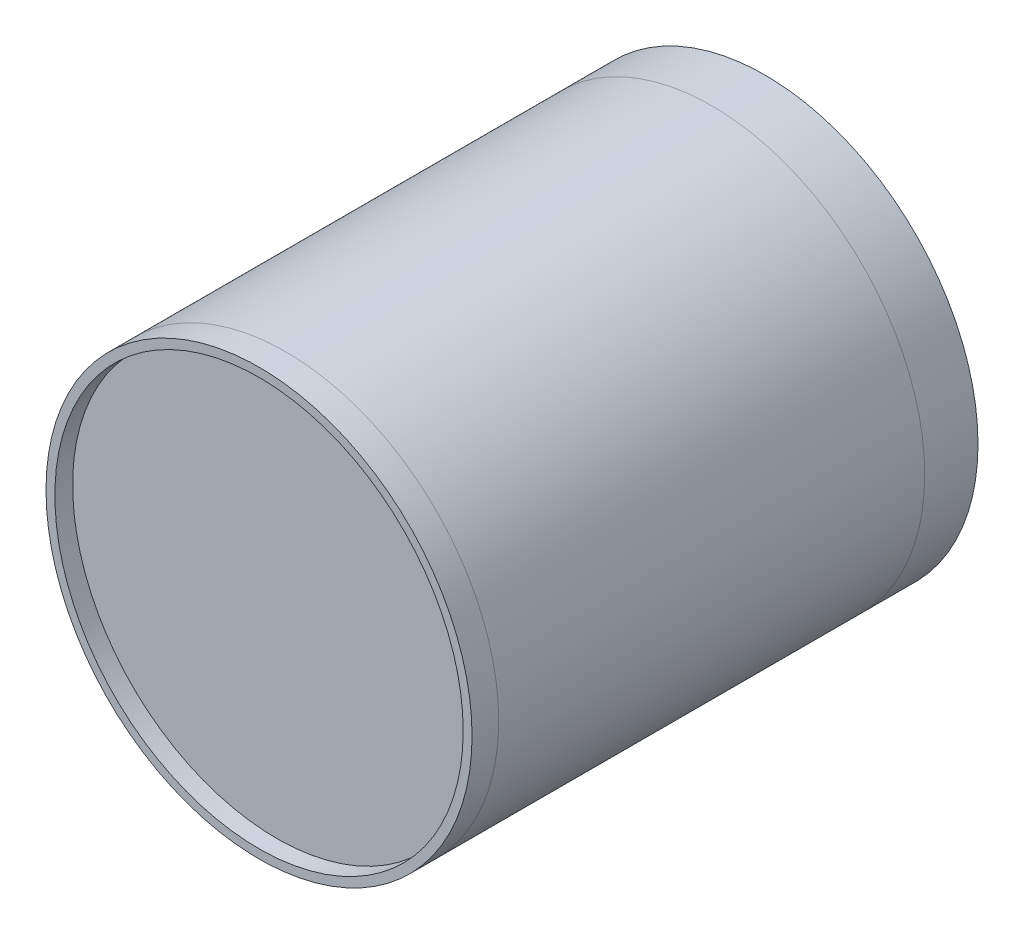
ISO-10303-21;
HEADER;
FILE_DESCRIPTION(('STEP AP214'),'2;1');
FILE_NAME('part.step','',(''),(''),'','','');
FILE_SCHEMA(('AUTOMOTIVE_DESIGN { 1 0 10303 214 1 1 1 1 }'));
ENDSEC;
DATA;
#1=APPLICATION_CONTEXT('core data for automotive mechanical design processes');
#2=APPLICATION_PROTOCOL_DEFINITION('international standard','automotive_design',2000,#1);
#3=PRODUCT_CONTEXT('',#1,'mechanical');
#4=PRODUCT('Part','Part','',(#3));
#5=PRODUCT_RELATED_PRODUCT_CATEGORY('part','',(#4));
#6=PRODUCT_DEFINITION_FORMATION('','',#4);
#7=PRODUCT_DEFINITION_CONTEXT('part definition',#1,'design');
#8=PRODUCT_DEFINITION('design','',#6,#7);
#9=PRODUCT_DEFINITION_SHAPE('','',#8);
#10=(LENGTH_UNIT() NAMED_UNIT(*) SI_UNIT(.MILLI.,.METRE.));
#11=(NAMED_UNIT(*) PLANE_ANGLE_UNIT() SI_UNIT($,.RADIAN.));
#12=(NAMED_UNIT(*) SI_UNIT($,.STERADIAN.) SOLID_ANGLE_UNIT());
#13=UNCERTAINTY_MEASURE_WITH_UNIT(LENGTH_MEASURE(1.E-05),#10,'distance_accuracy_value','');
#14=(GEOMETRIC_REPRESENTATION_CONTEXT(3) GLOBAL_UNCERTAINTY_ASSIGNED_CONTEXT((#13)) GLOBAL_UNIT_ASSIGNED_CONTEXT((#10,
#11,#12)) REPRESENTATION_CONTEXT('',''));
#15=CARTESIAN_POINT('',(0.,0.,0.));
#16=DIRECTION('',(0.,0.,1.));
#17=DIRECTION('',(1.,0.,0.));
#18=AXIS2_PLACEMENT_3D('',#15,#16,#17);
#19=CARTESIAN_POINT('',(0.,0.,1295.4));
#20=DIRECTION('',(0.,0.,-1.));
#21=DIRECTION('',(-1.,0.,0.));
#22=AXIS2_PLACEMENT_3D('',#19,#20,#21);
#23=CYLINDRICAL_SURFACE('',#22,609.6);
#24=CARTESIAN_POINT('',(0.,0.,1295.4));
#25=DIRECTION('',(0.,0.,1.));
#26=DIRECTION('',(1.,0.,0.));
#27=AXIS2_PLACEMENT_3D('',#24,#25,#26);
#28=CIRCLE('',#27,609.6);
#29=CARTESIAN_POINT('',(609.6,0.,1295.4));
#30=VERTEX_POINT('',#29);
#31=EDGE_CURVE('E12',#30,#30,#28,.T.);
#32=ORIENTED_EDGE('',*,*,#31,.F.);
#33=EDGE_LOOP('',(#32));
#34=FACE_BOUND('',#33,.T.);
#35=CARTESIAN_POINT('',(0.,0.,1219.2));
#36=DIRECTION('',(0.,0.,1.));
#37=DIRECTION('',(1.,0.,0.));
#38=AXIS2_PLACEMENT_3D('',#35,#36,#37);
#39=CIRCLE('',#38,609.6);
#40=CARTESIAN_POINT('',(609.6,0.,1219.2));
#41=VERTEX_POINT('',#40);
#42=EDGE_CURVE('E50',#41,#41,#39,.T.);
#43=ORIENTED_EDGE('',*,*,#42,.T.);
#44=EDGE_LOOP('',(#43));
#45=FACE_BOUND('',#44,.T.);
#46=ADVANCED_FACE('F47',(#34,#45),#23,.T.);
#47=CARTESIAN_POINT('',(0.,0.,1295.4));
#48=DIRECTION('',(0.,0.,1.));
#49=DIRECTION('',(1.,0.,0.));
#50=AXIS2_PLACEMENT_3D('',#47,#48,#49);
#51=PLANE('',#50);
#52=CARTESIAN_POINT('',(0.,0.,1295.4));
#53=DIRECTION('',(0.,0.,1.));
#54=DIRECTION('',(1.,0.,0.));
#55=AXIS2_PLACEMENT_3D('',#52,#53,#54);
#56=CIRCLE('',#55,584.2);
#57=CARTESIAN_POINT('',(584.2,0.,1295.4));
#58=VERTEX_POINT('',#57);
#59=EDGE_CURVE('E61',#58,#58,#56,.T.);
#60=ORIENTED_EDGE('',*,*,#59,.F.);
#61=EDGE_LOOP('',(#60));
#62=FACE_BOUND('',#61,.T.);
#63=ORIENTED_EDGE('',*,*,#31,.T.);
#64=EDGE_LOOP('',(#63));
#65=FACE_BOUND('',#64,.T.);
#66=ADVANCED_FACE('F67',(#62,#65),#51,.T.);
#67=CARTESIAN_POINT('',(0.,0.,1219.2));
#68=DIRECTION('',(0.,0.,1.));
#69=DIRECTION('',(1.,0.,0.));
#70=AXIS2_PLACEMENT_3D('',#67,#68,#69);
#71=PLANE('',#70);
#72=ORIENTED_EDGE('',*,*,#42,.F.);
#73=EDGE_LOOP('',(#72));
#74=FACE_BOUND('',#73,.T.);
#75=ADVANCED_FACE('F69',(#74),#71,.F.);
#76=CARTESIAN_POINT('',(0.,0.,-433.167126276724));
#77=DIRECTION('',(0.,0.,1.));
#78=DIRECTION('',(1.,0.,0.));
#79=AXIS2_PLACEMENT_3D('',#76,#77,#78);
#80=CYLINDRICAL_SURFACE('',#79,584.2);
#81=CARTESIAN_POINT('',(0.,0.,1244.6));
#82=DIRECTION('',(0.,0.,1.));
#83=DIRECTION('',(1.,0.,0.));
#84=AXIS2_PLACEMENT_3D('',#81,#82,#83);
#85=CIRCLE('',#84,584.2);
#86=CARTESIAN_POINT('',(584.2,0.,1244.6));
#87=VERTEX_POINT('',#86);
#88=EDGE_CURVE('E57',#87,#87,#85,.F.);
#89=ORIENTED_EDGE('',*,*,#88,.T.);
#90=EDGE_LOOP('',(#89));
#91=FACE_BOUND('',#90,.T.);
#92=ORIENTED_EDGE('',*,*,#59,.T.);
#93=EDGE_LOOP('',(#92));
#94=FACE_BOUND('',#93,.T.);
#95=ADVANCED_FACE('F65',(#91,#94),#80,.F.);
#96=CARTESIAN_POINT('',(0.,0.,1244.6));
#97=DIRECTION('',(0.,0.,1.));
#98=DIRECTION('',(1.,0.,0.));
#99=AXIS2_PLACEMENT_3D('',#96,#97,#98);
#100=PLANE('',#99);
#101=ORIENTED_EDGE('',*,*,#88,.F.);
#102=EDGE_LOOP('',(#101));
#103=FACE_BOUND('',#102,.T.);
#104=ADVANCED_FACE('F80',(#103),#100,.T.);
#105=CLOSED_SHELL('',(#46,#66,#75,#95,#104));
#106=MANIFOLD_SOLID_BREP('B2',#105);
#107=CARTESIAN_POINT('',(0.,0.,1219.2));
#108=DIRECTION('',(0.,0.,-1.));
#109=DIRECTION('',(-1.,0.,0.));
#110=AXIS2_PLACEMENT_3D('',#107,#108,#109);
#111=CYLINDRICAL_SURFACE('',#110,603.25);
#112=CARTESIAN_POINT('',(0.,0.,1219.2));
#113=DIRECTION('',(0.,0.,1.));
#114=DIRECTION('',(1.,0.,0.));
#115=AXIS2_PLACEMENT_3D('',#112,#113,#114);
#116=CIRCLE('',#115,603.25);
#117=CARTESIAN_POINT('',(603.25,0.,1219.2));
#118=VERTEX_POINT('',#117);
#119=EDGE_CURVE('E145',#118,#118,#116,.T.);
#120=ORIENTED_EDGE('',*,*,#119,.T.);
#121=EDGE_LOOP('',(#120));
#122=FACE_BOUND('',#121,.T.);
#123=CARTESIAN_POINT('',(0.,0.,0.));
#124=DIRECTION('',(0.,0.,1.));
#125=DIRECTION('',(1.,0.,0.));
#126=AXIS2_PLACEMENT_3D('',#123,#124,#125);
#127=CIRCLE('',#126,603.25);
#128=CARTESIAN_POINT('',(603.25,0.,0.));
#129=VERTEX_POINT('',#128);
#130=EDGE_CURVE('E151',#129,#129,#127,.T.);
#131=ORIENTED_EDGE('',*,*,#130,.F.);
#132=EDGE_LOOP('',(#131));
#133=FACE_BOUND('',#132,.T.);
#134=ADVANCED_FACE('F138',(#122,#133),#111,.F.);
#135=CARTESIAN_POINT('',(0.,0.,1219.2));
#136=DIRECTION('',(0.,0.,-1.));
#137=DIRECTION('',(-1.,0.,0.));
#138=AXIS2_PLACEMENT_3D('',#135,#136,#137);
#139=CYLINDRICAL_SURFACE('',#138,609.6);
#140=CARTESIAN_POINT('',(0.,0.,1219.2));
#141=DIRECTION('',(0.,0.,1.));
#142=DIRECTION('',(1.,0.,0.));
#143=AXIS2_PLACEMENT_3D('',#140,#141,#142);
#144=CIRCLE('',#143,609.6);
#145=CARTESIAN_POINT('',(609.6,0.,1219.2));
#146=VERTEX_POINT('',#145);
#147=EDGE_CURVE('E46',#146,#146,#144,.T.);
#148=ORIENTED_EDGE('',*,*,#147,.F.);
#149=EDGE_LOOP('',(#148));
#150=FACE_BOUND('',#149,.T.);
#151=CARTESIAN_POINT('',(0.,0.,0.));
#152=DIRECTION('',(0.,0.,1.));
#153=DIRECTION('',(1.,0.,0.));
#154=AXIS2_PLACEMENT_3D('',#151,#152,#153);
#155=CIRCLE('',#154,609.6);
#156=CARTESIAN_POINT('',(609.6,0.,0.));
#157=VERTEX_POINT('',#156);
#158=EDGE_CURVE('E141',#157,#157,#155,.T.);
#159=ORIENTED_EDGE('',*,*,#158,.T.);
#160=EDGE_LOOP('',(#159));
#161=FACE_BOUND('',#160,.T.);
#162=ADVANCED_FACE('F158',(#150,#161),#139,.T.);
#163=CARTESIAN_POINT('',(0.,0.,1219.2));
#164=DIRECTION('',(0.,0.,1.));
#165=DIRECTION('',(1.,0.,0.));
#166=AXIS2_PLACEMENT_3D('',#163,#164,#165);
#167=PLANE('',#166);
#168=ORIENTED_EDGE('',*,*,#119,.F.);
#169=EDGE_LOOP('',(#168));
#170=FACE_BOUND('',#169,.T.);
#171=ORIENTED_EDGE('',*,*,#147,.T.);
#172=EDGE_LOOP('',(#171));
#173=FACE_BOUND('',#172,.T.);
#174=ADVANCED_FACE('F162',(#170,#173),#167,.T.);
#175=CARTESIAN_POINT('',(0.,0.,0.));
#176=DIRECTION('',(0.,0.,1.));
#177=DIRECTION('',(1.,0.,0.));
#178=AXIS2_PLACEMENT_3D('',#175,#176,#177);
#179=PLANE('',#178);
#180=ORIENTED_EDGE('',*,*,#130,.T.);
#181=EDGE_LOOP('',(#180));
#182=FACE_BOUND('',#181,.T.);
#183=ORIENTED_EDGE('',*,*,#158,.F.);
#184=EDGE_LOOP('',(#183));
#185=FACE_BOUND('',#184,.T.);
#186=ADVANCED_FACE('F160',(#182,#185),#179,.F.);
#187=CLOSED_SHELL('',(#134,#162,#174,#186));
#188=MANIFOLD_SOLID_BREP('B7_NOT_SHOWN',#187);
#189=CARTESIAN_POINT('',(0.,0.,-152.4));
#190=DIRECTION('',(0.,0.,1.));
#191=DIRECTION('',(1.,0.,0.));
#192=AXIS2_PLACEMENT_3D('',#189,#190,#191);
#193=CYLINDRICAL_SURFACE('',#192,609.6);
#194=CARTESIAN_POINT('',(0.,0.,-152.4));
#195=DIRECTION('',(0.,0.,1.));
#196=DIRECTION('',(1.,0.,0.));
#197=AXIS2_PLACEMENT_3D('',#194,#195,#196);
#198=CIRCLE('',#197,609.6);
#199=CARTESIAN_POINT('',(609.6,0.,-152.4));
#200=VERTEX_POINT('',#199);
#201=EDGE_CURVE('E137',#200,#200,#198,.T.);
#202=ORIENTED_EDGE('',*,*,#201,.T.);
#203=EDGE_LOOP('',(#202));
#204=FACE_BOUND('',#203,.T.);
#205=CARTESIAN_POINT('',(0.,0.,0.));
#206=DIRECTION('',(0.,0.,1.));
#207=DIRECTION('',(1.,0.,0.));
#208=AXIS2_PLACEMENT_3D('',#205,#206,#207);
#209=CIRCLE('',#208,609.6);
#210=CARTESIAN_POINT('',(609.6,0.,0.));
#211=VERTEX_POINT('',#210);
#212=EDGE_CURVE('E209',#211,#211,#209,.T.);
#213=ORIENTED_EDGE('',*,*,#212,.F.);
#214=EDGE_LOOP('',(#213));
#215=FACE_BOUND('',#214,.T.);
#216=ADVANCED_FACE('F202',(#204,#215),#193,.T.);
#217=CARTESIAN_POINT('',(0.,0.,-152.4));
#218=DIRECTION('',(0.,0.,1.));
#219=DIRECTION('',(1.,0.,0.));
#220=AXIS2_PLACEMENT_3D('',#217,#218,#219);
#221=PLANE('',#220);
#222=ORIENTED_EDGE('',*,*,#201,.F.);
#223=EDGE_LOOP('',(#222));
#224=FACE_BOUND('',#223,.T.);
#225=ADVANCED_FACE('F244',(#224),#221,.F.);
#226=CARTESIAN_POINT('',(0.,0.,0.));
#227=DIRECTION('',(0.,0.,1.));
#228=DIRECTION('',(1.,0.,0.));
#229=AXIS2_PLACEMENT_3D('',#226,#227,#228);
#230=PLANE('',#229);
#231=CARTESIAN_POINT('',(0.,0.,0.));
#232=DIRECTION('',(0.,0.,1.));
#233=DIRECTION('',(1.,0.,0.));
#234=AXIS2_PLACEMENT_3D('',#231,#232,#233);
#235=CIRCLE('',#234,76.2);
#236=CARTESIAN_POINT('',(76.2,0.,0.));
#237=VERTEX_POINT('',#236);
#238=EDGE_CURVE('E216',#237,#237,#235,.T.);
#239=ORIENTED_EDGE('',*,*,#238,.F.);
#240=EDGE_LOOP('',(#239));
#241=FACE_BOUND('',#240,.T.);
#242=ORIENTED_EDGE('',*,*,#212,.T.);
#243=EDGE_LOOP('',(#242));
#244=FACE_BOUND('',#243,.T.);
#245=ADVANCED_FACE('F248',(#241,#244),#230,.T.);
#246=CARTESIAN_POINT('',(0.,0.,25.4));
#247=DIRECTION('',(0.,0.,-1.));
#248=DIRECTION('',(-1.,0.,0.));
#249=AXIS2_PLACEMENT_3D('',#246,#247,#248);
#250=CYLINDRICAL_SURFACE('',#249,76.2);
#251=CARTESIAN_POINT('',(0.,0.,25.4));
#252=DIRECTION('',(0.,0.,1.));
#253=DIRECTION('',(1.,0.,0.));
#254=AXIS2_PLACEMENT_3D('',#251,#252,#253);
#255=CIRCLE('',#254,76.2);
#256=CARTESIAN_POINT('',(76.2,0.,25.4));
#257=VERTEX_POINT('',#256);
#258=EDGE_CURVE('E214',#257,#257,#255,.T.);
#259=ORIENTED_EDGE('',*,*,#258,.F.);
#260=EDGE_LOOP('',(#259));
#261=FACE_BOUND('',#260,.T.);
#262=ORIENTED_EDGE('',*,*,#238,.T.);
#263=EDGE_LOOP('',(#262));
#264=FACE_BOUND('',#263,.T.);
#265=ADVANCED_FACE('F241',(#261,#264),#250,.T.);
#266=CARTESIAN_POINT('',(0.,0.,25.4));
#267=DIRECTION('',(0.,0.,1.));
#268=DIRECTION('',(1.,0.,0.));
#269=AXIS2_PLACEMENT_3D('',#266,#267,#268);
#270=PLANE('',#269);
#271=CARTESIAN_POINT('',(0.,0.,25.4));
#272=DIRECTION('',(0.,0.,1.));
#273=DIRECTION('',(1.,0.,0.));
#274=AXIS2_PLACEMENT_3D('',#271,#272,#273);
#275=CIRCLE('',#274,25.4);
#276=CARTESIAN_POINT('',(25.4,0.,25.4));
#277=VERTEX_POINT('',#276);
#278=EDGE_CURVE('E205',#277,#277,#275,.F.);
#279=ORIENTED_EDGE('',*,*,#278,.T.);
#280=EDGE_LOOP('',(#279));
#281=FACE_BOUND('',#280,.T.);
#282=ORIENTED_EDGE('',*,*,#258,.T.);
#283=EDGE_LOOP('',(#282));
#284=FACE_BOUND('',#283,.T.);
#285=ADVANCED_FACE('F228',(#281,#284),#270,.T.);
#286=CARTESIAN_POINT('',(0.,0.,50.8));
#287=DIRECTION('',(0.,0.,-1.));
#288=DIRECTION('',(-1.,0.,0.));
#289=AXIS2_PLACEMENT_3D('',#286,#287,#288);
#290=CYLINDRICAL_SURFACE('',#289,25.4);
#291=ORIENTED_EDGE('',*,*,#278,.F.);
#292=EDGE_LOOP('',(#291));
#293=FACE_BOUND('',#292,.T.);
#294=CARTESIAN_POINT('',(0.,0.,50.8));
#295=DIRECTION('',(0.,0.,1.));
#296=DIRECTION('',(1.,0.,0.));
#297=AXIS2_PLACEMENT_3D('',#294,#295,#296);
#298=CIRCLE('',#297,25.4);
#299=CARTESIAN_POINT('',(25.4,0.,50.8));
#300=VERTEX_POINT('',#299);
#301=EDGE_CURVE('E221',#300,#300,#298,.T.);
#302=ORIENTED_EDGE('',*,*,#301,.F.);
#303=EDGE_LOOP('',(#302));
#304=FACE_BOUND('',#303,.T.);
#305=ADVANCED_FACE('F231',(#293,#304),#290,.T.);
#306=CARTESIAN_POINT('',(0.,0.,50.8));
#307=DIRECTION('',(0.,0.,1.));
#308=DIRECTION('',(1.,0.,0.));
#309=AXIS2_PLACEMENT_3D('',#306,#307,#308);
#310=PLANE('',#309);
#311=ORIENTED_EDGE('',*,*,#301,.T.);
#312=EDGE_LOOP('',(#311));
#313=FACE_BOUND('',#312,.T.);
#314=ADVANCED_FACE('F234',(#313),#310,.T.);
#315=CLOSED_SHELL('',(#216,#225,#245,#265,#285,#305,#314));
#316=MANIFOLD_SOLID_BREP('B41',#315);
#317=ADVANCED_BREP_SHAPE_REPRESENTATION('',(#18,#106,#188,#316),#14);
#318=SHAPE_DEFINITION_REPRESENTATION(#9,#317);
ENDSEC;
END-ISO-10303-21;
